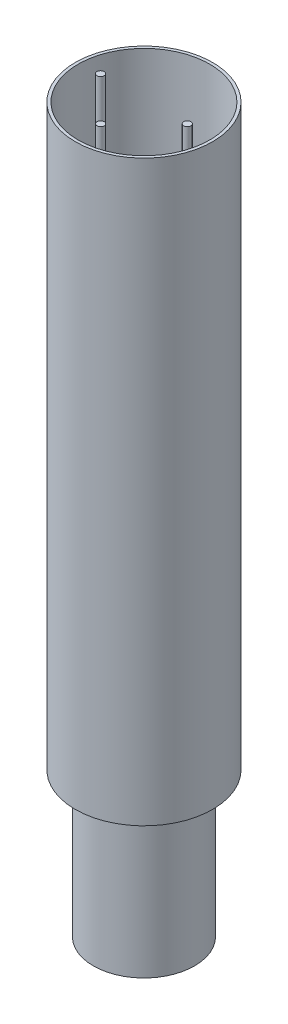
ISO-10303-21;
HEADER;
FILE_DESCRIPTION(('STEP AP214'),'2;1');
FILE_NAME('part.step','',(''),(''),'','','');
FILE_SCHEMA(('AUTOMOTIVE_DESIGN { 1 0 10303 214 1 1 1 1 }'));
ENDSEC;
DATA;
#1=APPLICATION_CONTEXT('core data for automotive mechanical design processes');
#2=APPLICATION_PROTOCOL_DEFINITION('international standard','automotive_design',2000,#1);
#3=PRODUCT_CONTEXT('',#1,'mechanical');
#4=PRODUCT('Part','Part','',(#3));
#5=PRODUCT_RELATED_PRODUCT_CATEGORY('part','',(#4));
#6=PRODUCT_DEFINITION_FORMATION('','',#4);
#7=PRODUCT_DEFINITION_CONTEXT('part definition',#1,'design');
#8=PRODUCT_DEFINITION('design','',#6,#7);
#9=PRODUCT_DEFINITION_SHAPE('','',#8);
#10=(LENGTH_UNIT() NAMED_UNIT(*) SI_UNIT(.MILLI.,.METRE.));
#11=(NAMED_UNIT(*) PLANE_ANGLE_UNIT() SI_UNIT($,.RADIAN.));
#12=(NAMED_UNIT(*) SI_UNIT($,.STERADIAN.) SOLID_ANGLE_UNIT());
#13=UNCERTAINTY_MEASURE_WITH_UNIT(LENGTH_MEASURE(1.E-05),#10,'distance_accuracy_value','');
#14=(GEOMETRIC_REPRESENTATION_CONTEXT(3) GLOBAL_UNCERTAINTY_ASSIGNED_CONTEXT((#13)) GLOBAL_UNIT_ASSIGNED_CONTEXT((#10,
#11,#12)) REPRESENTATION_CONTEXT('',''));
#15=CARTESIAN_POINT('',(0.,0.,0.));
#16=DIRECTION('',(0.,0.,1.));
#17=DIRECTION('',(1.,0.,0.));
#18=AXIS2_PLACEMENT_3D('',#15,#16,#17);
#19=CARTESIAN_POINT('',(0.,502.,30.));
#20=DIRECTION('',(0.,-1.,0.));
#21=DIRECTION('',(0.,0.,-1.));
#22=AXIS2_PLACEMENT_3D('',#19,#20,#21);
#23=CYLINDRICAL_SURFACE('',#22,2.5);
#24=CARTESIAN_POINT('',(0.,502.,30.));
#25=DIRECTION('',(0.,1.,0.));
#26=DIRECTION('',(0.,0.,1.));
#27=AXIS2_PLACEMENT_3D('',#24,#25,#26);
#28=CIRCLE('',#27,2.5);
#29=CARTESIAN_POINT('',(0.,502.,32.5));
#30=VERTEX_POINT('',#29);
#31=EDGE_CURVE('E48',#30,#30,#28,.T.);
#32=ORIENTED_EDGE('',*,*,#31,.F.);
#33=EDGE_LOOP('',(#32));
#34=FACE_BOUND('',#33,.T.);
#35=CARTESIAN_POINT('',(0.,102.,30.));
#36=DIRECTION('',(0.,1.,0.));
#37=DIRECTION('',(0.,0.,1.));
#38=AXIS2_PLACEMENT_3D('',#35,#36,#37);
#39=CIRCLE('',#38,2.5);
#40=CARTESIAN_POINT('',(0.,102.,32.5));
#41=VERTEX_POINT('',#40);
#42=EDGE_CURVE('E11',#41,#41,#39,.T.);
#43=ORIENTED_EDGE('',*,*,#42,.T.);
#44=EDGE_LOOP('',(#43));
#45=FACE_BOUND('',#44,.T.);
#46=ADVANCED_FACE('F44',(#34,#45),#23,.T.);
#47=CARTESIAN_POINT('',(0.,502.,30.));
#48=DIRECTION('',(0.,1.,0.));
#49=DIRECTION('',(0.,0.,1.));
#50=AXIS2_PLACEMENT_3D('',#47,#48,#49);
#51=PLANE('',#50);
#52=ORIENTED_EDGE('',*,*,#31,.T.);
#53=EDGE_LOOP('',(#52));
#54=FACE_BOUND('',#53,.T.);
#55=ADVANCED_FACE('F46',(#54),#51,.T.);
#56=CARTESIAN_POINT('',(0.,102.,30.));
#57=DIRECTION('',(0.,1.,0.));
#58=DIRECTION('',(0.,0.,1.));
#59=AXIS2_PLACEMENT_3D('',#56,#57,#58);
#60=PLANE('',#59);
#61=ORIENTED_EDGE('',*,*,#42,.F.);
#62=EDGE_LOOP('',(#61));
#63=FACE_BOUND('',#62,.T.);
#64=ADVANCED_FACE('F63',(#63),#60,.F.);
#65=CLOSED_SHELL('',(#46,#55,#64));
#66=MANIFOLD_SOLID_BREP('B2',#65);
#67=CARTESIAN_POINT('',(30.,502.,-1.11577413974828E-13));
#68=DIRECTION('',(0.,-1.,0.));
#69=DIRECTION('',(0.,0.,-1.));
#70=AXIS2_PLACEMENT_3D('',#67,#68,#69);
#71=CYLINDRICAL_SURFACE('',#70,2.5);
#72=CARTESIAN_POINT('',(30.,502.,-1.11577413974828E-13));
#73=DIRECTION('',(0.,1.,0.));
#74=DIRECTION('',(0.,0.,1.));
#75=AXIS2_PLACEMENT_3D('',#72,#73,#74);
#76=CIRCLE('',#75,2.5);
#77=CARTESIAN_POINT('',(30.,502.,2.49999999999989));
#78=VERTEX_POINT('',#77);
#79=EDGE_CURVE('E103',#78,#78,#76,.T.);
#80=ORIENTED_EDGE('',*,*,#79,.F.);
#81=EDGE_LOOP('',(#80));
#82=FACE_BOUND('',#81,.T.);
#83=CARTESIAN_POINT('',(30.,102.,-1.11577413974828E-13));
#84=DIRECTION('',(0.,1.,0.));
#85=DIRECTION('',(0.,0.,1.));
#86=AXIS2_PLACEMENT_3D('',#83,#84,#85);
#87=CIRCLE('',#86,2.5);
#88=CARTESIAN_POINT('',(30.,102.,2.49999999999989));
#89=VERTEX_POINT('',#88);
#90=EDGE_CURVE('E43',#89,#89,#87,.T.);
#91=ORIENTED_EDGE('',*,*,#90,.T.);
#92=EDGE_LOOP('',(#91));
#93=FACE_BOUND('',#92,.T.);
#94=ADVANCED_FACE('F99',(#82,#93),#71,.T.);
#95=CARTESIAN_POINT('',(30.,502.,-1.11577413974828E-13));
#96=DIRECTION('',(0.,1.,0.));
#97=DIRECTION('',(0.,0.,1.));
#98=AXIS2_PLACEMENT_3D('',#95,#96,#97);
#99=PLANE('',#98);
#100=ORIENTED_EDGE('',*,*,#79,.T.);
#101=EDGE_LOOP('',(#100));
#102=FACE_BOUND('',#101,.T.);
#103=ADVANCED_FACE('F101',(#102),#99,.T.);
#104=CARTESIAN_POINT('',(30.,102.,-1.11577413974828E-13));
#105=DIRECTION('',(0.,1.,0.));
#106=DIRECTION('',(0.,0.,1.));
#107=AXIS2_PLACEMENT_3D('',#104,#105,#106);
#108=PLANE('',#107);
#109=ORIENTED_EDGE('',*,*,#90,.F.);
#110=EDGE_LOOP('',(#109));
#111=FACE_BOUND('',#110,.T.);
#112=ADVANCED_FACE('F118',(#111),#108,.F.);
#113=CLOSED_SHELL('',(#94,#103,#112));
#114=MANIFOLD_SOLID_BREP('B6',#113);
#115=CARTESIAN_POINT('',(-30.,502.,-1.04916075827077E-13));
#116=DIRECTION('',(0.,-1.,0.));
#117=DIRECTION('',(0.,0.,-1.));
#118=AXIS2_PLACEMENT_3D('',#115,#116,#117);
#119=CYLINDRICAL_SURFACE('',#118,2.5);
#120=CARTESIAN_POINT('',(-30.,502.,-1.04916075827077E-13));
#121=DIRECTION('',(0.,1.,0.));
#122=DIRECTION('',(0.,0.,1.));
#123=AXIS2_PLACEMENT_3D('',#120,#121,#122);
#124=CIRCLE('',#123,2.5);
#125=CARTESIAN_POINT('',(-30.,502.,2.49999999999989));
#126=VERTEX_POINT('',#125);
#127=EDGE_CURVE('E98',#126,#126,#124,.T.);
#128=ORIENTED_EDGE('',*,*,#127,.F.);
#129=EDGE_LOOP('',(#128));
#130=FACE_BOUND('',#129,.T.);
#131=CARTESIAN_POINT('',(-30.,102.,-1.04916075827077E-13));
#132=DIRECTION('',(0.,1.,0.));
#133=DIRECTION('',(0.,0.,1.));
#134=AXIS2_PLACEMENT_3D('',#131,#132,#133);
#135=CIRCLE('',#134,2.5);
#136=CARTESIAN_POINT('',(-30.,102.,2.49999999999989));
#137=VERTEX_POINT('',#136);
#138=EDGE_CURVE('E156',#137,#137,#135,.T.);
#139=ORIENTED_EDGE('',*,*,#138,.T.);
#140=EDGE_LOOP('',(#139));
#141=FACE_BOUND('',#140,.T.);
#142=ADVANCED_FACE('F153',(#130,#141),#119,.T.);
#143=CARTESIAN_POINT('',(-30.,502.,-1.04916075827077E-13));
#144=DIRECTION('',(0.,1.,0.));
#145=DIRECTION('',(0.,0.,1.));
#146=AXIS2_PLACEMENT_3D('',#143,#144,#145);
#147=PLANE('',#146);
#148=ORIENTED_EDGE('',*,*,#127,.T.);
#149=EDGE_LOOP('',(#148));
#150=FACE_BOUND('',#149,.T.);
#151=ADVANCED_FACE('F168',(#150),#147,.T.);
#152=CARTESIAN_POINT('',(-30.,102.,-1.04916075827077E-13));
#153=DIRECTION('',(0.,1.,0.));
#154=DIRECTION('',(0.,0.,1.));
#155=AXIS2_PLACEMENT_3D('',#152,#153,#154);
#156=PLANE('',#155);
#157=ORIENTED_EDGE('',*,*,#138,.F.);
#158=EDGE_LOOP('',(#157));
#159=FACE_BOUND('',#158,.T.);
#160=ADVANCED_FACE('F166',(#159),#156,.F.);
#161=CLOSED_SHELL('',(#142,#151,#160));
#162=MANIFOLD_SOLID_BREP('B38',#161);
#163=CARTESIAN_POINT('',(0.,100.,0.));
#164=DIRECTION('',(0.,-1.,0.));
#165=DIRECTION('',(0.,0.,-1.));
#166=AXIS2_PLACEMENT_3D('',#163,#164,#165);
#167=CYLINDRICAL_SURFACE('',#166,35.);
#168=CARTESIAN_POINT('',(0.,100.,0.));
#169=DIRECTION('',(0.,1.,0.));
#170=DIRECTION('',(0.,0.,1.));
#171=AXIS2_PLACEMENT_3D('',#168,#169,#170);
#172=CIRCLE('',#171,35.);
#173=CARTESIAN_POINT('',(0.,100.,35.));
#174=VERTEX_POINT('',#173);
#175=EDGE_CURVE('E152',#174,#174,#172,.T.);
#176=ORIENTED_EDGE('',*,*,#175,.F.);
#177=EDGE_LOOP('',(#176));
#178=FACE_BOUND('',#177,.T.);
#179=CARTESIAN_POINT('',(0.,0.,0.));
#180=DIRECTION('',(0.,1.,0.));
#181=DIRECTION('',(0.,0.,1.));
#182=AXIS2_PLACEMENT_3D('',#179,#180,#181);
#183=CIRCLE('',#182,35.);
#184=CARTESIAN_POINT('',(0.,0.,35.));
#185=VERTEX_POINT('',#184);
#186=EDGE_CURVE('E203',#185,#185,#183,.T.);
#187=ORIENTED_EDGE('',*,*,#186,.T.);
#188=EDGE_LOOP('',(#187));
#189=FACE_BOUND('',#188,.T.);
#190=ADVANCED_FACE('F200',(#178,#189),#167,.T.);
#191=CARTESIAN_POINT('',(0.,0.,0.));
#192=DIRECTION('',(0.,1.,0.));
#193=DIRECTION('',(0.,0.,1.));
#194=AXIS2_PLACEMENT_3D('',#191,#192,#193);
#195=PLANE('',#194);
#196=ORIENTED_EDGE('',*,*,#186,.F.);
#197=EDGE_LOOP('',(#196));
#198=FACE_BOUND('',#197,.T.);
#199=ADVANCED_FACE('F250',(#198),#195,.F.);
#200=CARTESIAN_POINT('',(0.,500.,0.));
#201=DIRECTION('',(0.,-1.,0.));
#202=DIRECTION('',(0.,0.,-1.));
#203=AXIS2_PLACEMENT_3D('',#200,#201,#202);
#204=CYLINDRICAL_SURFACE('',#203,47.5000000000001);
#205=CARTESIAN_POINT('',(0.,500.,0.));
#206=DIRECTION('',(0.,1.,0.));
#207=DIRECTION('',(0.,0.,1.));
#208=AXIS2_PLACEMENT_3D('',#205,#206,#207);
#209=CIRCLE('',#208,47.5000000000001);
#210=CARTESIAN_POINT('',(0.,500.,47.5000000000001));
#211=VERTEX_POINT('',#210);
#212=EDGE_CURVE('E210',#211,#211,#209,.T.);
#213=ORIENTED_EDGE('',*,*,#212,.F.);
#214=EDGE_LOOP('',(#213));
#215=FACE_BOUND('',#214,.T.);
#216=CARTESIAN_POINT('',(0.,100.,0.));
#217=DIRECTION('',(0.,1.,0.));
#218=DIRECTION('',(0.,0.,1.));
#219=AXIS2_PLACEMENT_3D('',#216,#217,#218);
#220=CIRCLE('',#219,47.5000000000001);
#221=CARTESIAN_POINT('',(0.,100.,47.5000000000001));
#222=VERTEX_POINT('',#221);
#223=EDGE_CURVE('E212',#222,#222,#220,.T.);
#224=ORIENTED_EDGE('',*,*,#223,.T.);
#225=EDGE_LOOP('',(#224));
#226=FACE_BOUND('',#225,.T.);
#227=ADVANCED_FACE('F255',(#215,#226),#204,.T.);
#228=CARTESIAN_POINT('',(0.,500.,0.));
#229=DIRECTION('',(0.,1.,0.));
#230=DIRECTION('',(0.,0.,1.));
#231=AXIS2_PLACEMENT_3D('',#228,#229,#230);
#232=PLANE('',#231);
#233=CARTESIAN_POINT('',(0.,500.,0.));
#234=DIRECTION('',(0.,1.,0.));
#235=DIRECTION('',(0.,0.,1.));
#236=AXIS2_PLACEMENT_3D('',#233,#234,#235);
#237=CIRCLE('',#236,45.5000000000001);
#238=CARTESIAN_POINT('',(0.,500.,45.5000000000001));
#239=VERTEX_POINT('',#238);
#240=EDGE_CURVE('E218',#239,#239,#237,.T.);
#241=ORIENTED_EDGE('',*,*,#240,.F.);
#242=EDGE_LOOP('',(#241));
#243=FACE_BOUND('',#242,.T.);
#244=ORIENTED_EDGE('',*,*,#212,.T.);
#245=EDGE_LOOP('',(#244));
#246=FACE_BOUND('',#245,.T.);
#247=ADVANCED_FACE('F262',(#243,#246),#232,.T.);
#248=CARTESIAN_POINT('',(0.,100.,0.));
#249=DIRECTION('',(0.,1.,0.));
#250=DIRECTION('',(0.,0.,1.));
#251=AXIS2_PLACEMENT_3D('',#248,#249,#250);
#252=PLANE('',#251);
#253=ORIENTED_EDGE('',*,*,#175,.T.);
#254=EDGE_LOOP('',(#253));
#255=FACE_BOUND('',#254,.T.);
#256=ORIENTED_EDGE('',*,*,#223,.F.);
#257=EDGE_LOOP('',(#256));
#258=FACE_BOUND('',#257,.T.);
#259=ADVANCED_FACE('F266',(#255,#258),#252,.F.);
#260=CARTESIAN_POINT('',(0.,100.,0.));
#261=DIRECTION('',(0.,-1.,0.));
#262=DIRECTION('',(0.,0.,-1.));
#263=AXIS2_PLACEMENT_3D('',#260,#261,#262);
#264=CYLINDRICAL_SURFACE('',#263,33.);
#265=CARTESIAN_POINT('',(0.,102.,0.));
#266=DIRECTION('',(0.,1.,0.));
#267=DIRECTION('',(0.,0.,1.));
#268=AXIS2_PLACEMENT_3D('',#265,#266,#267);
#269=CIRCLE('',#268,33.);
#270=CARTESIAN_POINT('',(0.,102.,33.));
#271=VERTEX_POINT('',#270);
#272=EDGE_CURVE('E215',#271,#271,#269,.T.);
#273=ORIENTED_EDGE('',*,*,#272,.T.);
#274=EDGE_LOOP('',(#273));
#275=FACE_BOUND('',#274,.T.);
#276=CARTESIAN_POINT('',(0.,2.,0.));
#277=DIRECTION('',(0.,1.,0.));
#278=DIRECTION('',(0.,0.,1.));
#279=AXIS2_PLACEMENT_3D('',#276,#277,#278);
#280=CIRCLE('',#279,33.);
#281=CARTESIAN_POINT('',(0.,2.,33.));
#282=VERTEX_POINT('',#281);
#283=EDGE_CURVE('E221',#282,#282,#280,.T.);
#284=ORIENTED_EDGE('',*,*,#283,.F.);
#285=EDGE_LOOP('',(#284));
#286=FACE_BOUND('',#285,.T.);
#287=ADVANCED_FACE('F230',(#275,#286),#264,.F.);
#288=CARTESIAN_POINT('',(0.,2.,0.));
#289=DIRECTION('',(0.,1.,0.));
#290=DIRECTION('',(0.,0.,1.));
#291=AXIS2_PLACEMENT_3D('',#288,#289,#290);
#292=PLANE('',#291);
#293=ORIENTED_EDGE('',*,*,#283,.T.);
#294=EDGE_LOOP('',(#293));
#295=FACE_BOUND('',#294,.T.);
#296=ADVANCED_FACE('F241',(#295),#292,.T.);
#297=CARTESIAN_POINT('',(0.,500.,0.));
#298=DIRECTION('',(0.,-1.,0.));
#299=DIRECTION('',(0.,0.,-1.));
#300=AXIS2_PLACEMENT_3D('',#297,#298,#299);
#301=CYLINDRICAL_SURFACE('',#300,45.5000000000001);
#302=ORIENTED_EDGE('',*,*,#240,.T.);
#303=EDGE_LOOP('',(#302));
#304=FACE_BOUND('',#303,.T.);
#305=CARTESIAN_POINT('',(0.,102.,0.));
#306=DIRECTION('',(0.,1.,0.));
#307=DIRECTION('',(0.,0.,1.));
#308=AXIS2_PLACEMENT_3D('',#305,#306,#307);
#309=CIRCLE('',#308,45.5000000000001);
#310=CARTESIAN_POINT('',(0.,102.,45.5000000000001));
#311=VERTEX_POINT('',#310);
#312=EDGE_CURVE('E222',#311,#311,#309,.T.);
#313=ORIENTED_EDGE('',*,*,#312,.F.);
#314=EDGE_LOOP('',(#313));
#315=FACE_BOUND('',#314,.T.);
#316=ADVANCED_FACE('F236',(#304,#315),#301,.F.);
#317=CARTESIAN_POINT('',(0.,102.,0.));
#318=DIRECTION('',(0.,1.,0.));
#319=DIRECTION('',(0.,0.,1.));
#320=AXIS2_PLACEMENT_3D('',#317,#318,#319);
#321=PLANE('',#320);
#322=ORIENTED_EDGE('',*,*,#272,.F.);
#323=EDGE_LOOP('',(#322));
#324=FACE_BOUND('',#323,.T.);
#325=ORIENTED_EDGE('',*,*,#312,.T.);
#326=EDGE_LOOP('',(#325));
#327=FACE_BOUND('',#326,.T.);
#328=ADVANCED_FACE('F233',(#324,#327),#321,.T.);
#329=CLOSED_SHELL('',(#190,#199,#227,#247,#259,#287,#296,#316,#328));
#330=MANIFOLD_SOLID_BREP('B93',#329);
#331=ADVANCED_BREP_SHAPE_REPRESENTATION('',(#18,#66,#114,#162,#330),#14);
#332=SHAPE_DEFINITION_REPRESENTATION(#9,#331);
ENDSEC;
END-ISO-10303-21;
